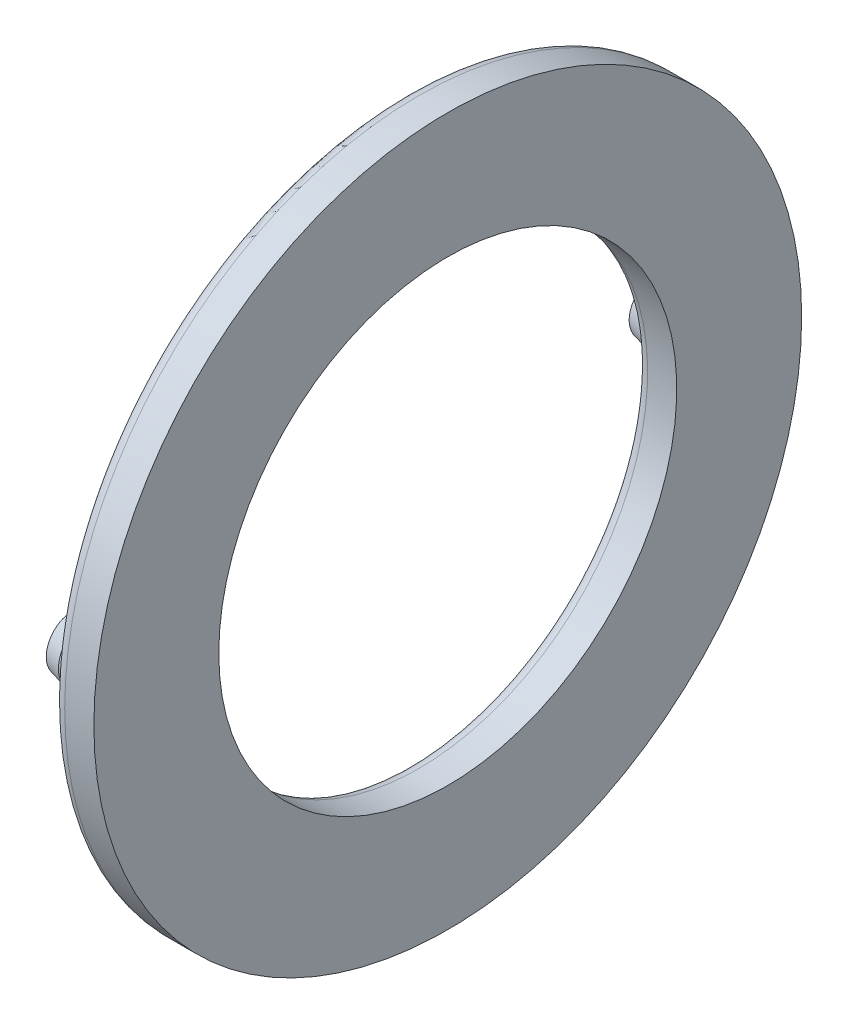
ISO-10303-21;
HEADER;
FILE_DESCRIPTION(('STEP AP214'),'2;1');
FILE_NAME('part.step','',(''),(''),'','','');
FILE_SCHEMA(('AUTOMOTIVE_DESIGN { 1 0 10303 214 1 1 1 1 }'));
ENDSEC;
DATA;
#1=APPLICATION_CONTEXT('core data for automotive mechanical design processes');
#2=APPLICATION_PROTOCOL_DEFINITION('international standard','automotive_design',2000,#1);
#3=PRODUCT_CONTEXT('',#1,'mechanical');
#4=PRODUCT('Part','Part','',(#3));
#5=PRODUCT_RELATED_PRODUCT_CATEGORY('part','',(#4));
#6=PRODUCT_DEFINITION_FORMATION('','',#4);
#7=PRODUCT_DEFINITION_CONTEXT('part definition',#1,'design');
#8=PRODUCT_DEFINITION('design','',#6,#7);
#9=PRODUCT_DEFINITION_SHAPE('','',#8);
#10=(LENGTH_UNIT() NAMED_UNIT(*) SI_UNIT(.MILLI.,.METRE.));
#11=(NAMED_UNIT(*) PLANE_ANGLE_UNIT() SI_UNIT($,.RADIAN.));
#12=(NAMED_UNIT(*) SI_UNIT($,.STERADIAN.) SOLID_ANGLE_UNIT());
#13=UNCERTAINTY_MEASURE_WITH_UNIT(LENGTH_MEASURE(1.E-05),#10,'distance_accuracy_value','');
#14=(GEOMETRIC_REPRESENTATION_CONTEXT(3) GLOBAL_UNCERTAINTY_ASSIGNED_CONTEXT((#13)) GLOBAL_UNIT_ASSIGNED_CONTEXT((#10,
#11,#12)) REPRESENTATION_CONTEXT('',''));
#15=CARTESIAN_POINT('',(0.,0.,0.));
#16=DIRECTION('',(0.,0.,1.));
#17=DIRECTION('',(1.,0.,0.));
#18=AXIS2_PLACEMENT_3D('',#15,#16,#17);
#19=CARTESIAN_POINT('',(5.5,15.,7.));
#20=DIRECTION('',(-1.,0.,0.));
#21=DIRECTION('',(0.,0.,1.));
#22=AXIS2_PLACEMENT_3D('',#19,#20,#21);
#23=PLANE('',#22);
#24=CARTESIAN_POINT('',(5.49999999998363,15.,7.));
#25=DIRECTION('',(1.,0.,0.));
#26=DIRECTION('',(0.,0.,-1.));
#27=AXIS2_PLACEMENT_3D('',#24,#25,#26);
#28=CIRCLE('',#27,0.642820323022304);
#29=CARTESIAN_POINT('',(5.49999999998363,15.,6.3571796769777));
#30=VERTEX_POINT('',#29);
#31=EDGE_CURVE('E18',#30,#30,#28,.T.);
#32=ORIENTED_EDGE('',*,*,#31,.F.);
#33=EDGE_LOOP('',(#32));
#34=FACE_BOUND('',#33,.T.);
#35=ADVANCED_FACE('F15',(#34),#23,.T.);
#36=CARTESIAN_POINT('',(5.50000000000001,15.,-7.));
#37=DIRECTION('',(-1.,0.,0.));
#38=DIRECTION('',(0.,0.,1.));
#39=AXIS2_PLACEMENT_3D('',#36,#37,#38);
#40=PLANE('',#39);
#41=CARTESIAN_POINT('',(5.49999999998363,15.,-7.));
#42=DIRECTION('',(1.,0.,0.));
#43=DIRECTION('',(0.,0.,-1.));
#44=AXIS2_PLACEMENT_3D('',#41,#42,#43);
#45=CIRCLE('',#44,0.642820323022316);
#46=CARTESIAN_POINT('',(5.49999999998363,15.,-7.64282032302232));
#47=VERTEX_POINT('',#46);
#48=EDGE_CURVE('E32',#47,#47,#45,.T.);
#49=ORIENTED_EDGE('',*,*,#48,.F.);
#50=EDGE_LOOP('',(#49));
#51=FACE_BOUND('',#50,.T.);
#52=ADVANCED_FACE('F45',(#51),#40,.T.);
#53=CARTESIAN_POINT('',(5.90000000005375,15.,7.));
#54=DIRECTION('',(1.,0.,0.));
#55=DIRECTION('',(0.,0.,-1.));
#56=AXIS2_PLACEMENT_3D('',#53,#54,#55);
#57=CONICAL_SURFACE('',#56,0.750000000024327,0.261799387824305);
#58=ORIENTED_EDGE('',*,*,#31,.T.);
#59=EDGE_LOOP('',(#58));
#60=FACE_BOUND('',#59,.T.);
#61=CARTESIAN_POINT('',(5.90000000000001,15.,7.));
#62=DIRECTION('',(-1.,0.,0.));
#63=DIRECTION('',(0.,0.,1.));
#64=AXIS2_PLACEMENT_3D('',#61,#62,#63);
#65=CIRCLE('',#64,0.75);
#66=CARTESIAN_POINT('',(5.90000000000001,15.,7.75));
#67=VERTEX_POINT('',#66);
#68=EDGE_CURVE('E30',#67,#67,#65,.F.);
#69=ORIENTED_EDGE('',*,*,#68,.F.);
#70=EDGE_LOOP('',(#69));
#71=FACE_BOUND('',#70,.T.);
#72=ADVANCED_FACE('F41',(#60,#71),#57,.T.);
#73=CARTESIAN_POINT('',(5.90000000005375,15.,-7.));
#74=DIRECTION('',(1.,0.,0.));
#75=DIRECTION('',(0.,0.,-1.));
#76=AXIS2_PLACEMENT_3D('',#73,#74,#75);
#77=CONICAL_SURFACE('',#76,0.750000000024339,0.261799387824305);
#78=ORIENTED_EDGE('',*,*,#48,.T.);
#79=EDGE_LOOP('',(#78));
#80=FACE_BOUND('',#79,.T.);
#81=CARTESIAN_POINT('',(5.90000000000002,15.,-7.));
#82=DIRECTION('',(-1.,0.,0.));
#83=DIRECTION('',(0.,0.,1.));
#84=AXIS2_PLACEMENT_3D('',#81,#82,#83);
#85=CIRCLE('',#84,0.75);
#86=CARTESIAN_POINT('',(5.90000000000002,15.,-6.25));
#87=VERTEX_POINT('',#86);
#88=EDGE_CURVE('E37',#87,#87,#85,.F.);
#89=ORIENTED_EDGE('',*,*,#88,.F.);
#90=EDGE_LOOP('',(#89));
#91=FACE_BOUND('',#90,.T.);
#92=ADVANCED_FACE('F202',(#80,#91),#77,.T.);
#93=CARTESIAN_POINT('',(5.5,15.,7.));
#94=DIRECTION('',(-1.,0.,0.));
#95=DIRECTION('',(0.,0.,1.));
#96=AXIS2_PLACEMENT_3D('',#93,#94,#95);
#97=CYLINDRICAL_SURFACE('',#96,0.75);
#98=ORIENTED_EDGE('',*,*,#68,.T.);
#99=EDGE_LOOP('',(#98));
#100=FACE_BOUND('',#99,.T.);
#101=CARTESIAN_POINT('',(6.3,15.,7.));
#102=DIRECTION('',(-1.,0.,0.));
#103=DIRECTION('',(0.,1.,0.));
#104=AXIS2_PLACEMENT_3D('',#101,#102,#103);
#105=CIRCLE('',#104,0.750000000000002);
#106=CARTESIAN_POINT('',(6.3,15.75,7.));
#107=VERTEX_POINT('',#106);
#108=EDGE_CURVE('E161',#107,#107,#105,.T.);
#109=ORIENTED_EDGE('',*,*,#108,.T.);
#110=EDGE_LOOP('',(#109));
#111=FACE_BOUND('',#110,.T.);
#112=ADVANCED_FACE('F199',(#100,#111),#97,.T.);
#113=CARTESIAN_POINT('',(5.50000000000001,15.,-7.));
#114=DIRECTION('',(-1.,0.,0.));
#115=DIRECTION('',(0.,0.,1.));
#116=AXIS2_PLACEMENT_3D('',#113,#114,#115);
#117=CYLINDRICAL_SURFACE('',#116,0.75);
#118=ORIENTED_EDGE('',*,*,#88,.T.);
#119=EDGE_LOOP('',(#118));
#120=FACE_BOUND('',#119,.T.);
#121=CARTESIAN_POINT('',(6.30000000000001,15.,-7.));
#122=DIRECTION('',(-1.,0.,0.));
#123=DIRECTION('',(0.,1.,0.));
#124=AXIS2_PLACEMENT_3D('',#121,#122,#123);
#125=CIRCLE('',#124,0.750000000000001);
#126=CARTESIAN_POINT('',(6.30000000000001,15.75,-7.));
#127=VERTEX_POINT('',#126);
#128=EDGE_CURVE('E157',#127,#127,#125,.T.);
#129=ORIENTED_EDGE('',*,*,#128,.T.);
#130=EDGE_LOOP('',(#129));
#131=FACE_BOUND('',#130,.T.);
#132=ADVANCED_FACE('F181',(#120,#131),#117,.T.);
#133=CARTESIAN_POINT('',(6.3,15.,7.));
#134=DIRECTION('',(-1.,0.,0.));
#135=DIRECTION('',(0.,1.,0.));
#136=AXIS2_PLACEMENT_3D('',#133,#134,#135);
#137=TOROIDAL_SURFACE('',#136,0.950000000000001,0.2);
#138=CARTESIAN_POINT('',(6.5,15.,7.));
#139=DIRECTION('',(-1.,0.,0.));
#140=DIRECTION('',(0.,1.,0.));
#141=AXIS2_PLACEMENT_3D('',#138,#139,#140);
#142=CIRCLE('',#141,0.950000000000001);
#143=CARTESIAN_POINT('',(6.5,15.95,7.));
#144=VERTEX_POINT('',#143);
#145=EDGE_CURVE('E160',#144,#144,#142,.F.);
#146=ORIENTED_EDGE('',*,*,#145,.F.);
#147=EDGE_LOOP('',(#146));
#148=FACE_BOUND('',#147,.T.);
#149=ORIENTED_EDGE('',*,*,#108,.F.);
#150=EDGE_LOOP('',(#149));
#151=FACE_BOUND('',#150,.T.);
#152=ADVANCED_FACE('F177',(#148,#151),#137,.F.);
#153=CARTESIAN_POINT('',(6.30000000000001,15.,-7.));
#154=DIRECTION('',(-1.,0.,0.));
#155=DIRECTION('',(0.,1.,0.));
#156=AXIS2_PLACEMENT_3D('',#153,#154,#155);
#157=TOROIDAL_SURFACE('',#156,0.95,0.2);
#158=CARTESIAN_POINT('',(6.50000000000001,15.,-7.));
#159=DIRECTION('',(-1.,0.,0.));
#160=DIRECTION('',(0.,1.,0.));
#161=AXIS2_PLACEMENT_3D('',#158,#159,#160);
#162=CIRCLE('',#161,0.95);
#163=CARTESIAN_POINT('',(6.50000000000001,15.95,-7.));
#164=VERTEX_POINT('',#163);
#165=EDGE_CURVE('E165',#164,#164,#162,.F.);
#166=ORIENTED_EDGE('',*,*,#165,.F.);
#167=EDGE_LOOP('',(#166));
#168=FACE_BOUND('',#167,.T.);
#169=ORIENTED_EDGE('',*,*,#128,.F.);
#170=EDGE_LOOP('',(#169));
#171=FACE_BOUND('',#170,.T.);
#172=ADVANCED_FACE('F105',(#168,#171),#157,.F.);
#173=CARTESIAN_POINT('',(6.5,15.,0.));
#174=DIRECTION('',(-1.,0.,0.));
#175=DIRECTION('',(0.,0.,1.));
#176=AXIS2_PLACEMENT_3D('',#173,#174,#175);
#177=PLANE('',#176);
#178=CARTESIAN_POINT('',(6.5,15.,0.));
#179=DIRECTION('',(-1.,0.,0.));
#180=DIRECTION('',(0.,1.,0.));
#181=AXIS2_PLACEMENT_3D('',#178,#179,#180);
#182=CIRCLE('',#181,5.8);
#183=CARTESIAN_POINT('',(6.5,20.8,0.));
#184=VERTEX_POINT('',#183);
#185=EDGE_CURVE('E85',#184,#184,#182,.T.);
#186=ORIENTED_EDGE('',*,*,#185,.F.);
#187=EDGE_LOOP('',(#186));
#188=FACE_BOUND('',#187,.T.);
#189=ORIENTED_EDGE('',*,*,#165,.T.);
#190=EDGE_LOOP('',(#189));
#191=FACE_BOUND('',#190,.T.);
#192=ORIENTED_EDGE('',*,*,#145,.T.);
#193=EDGE_LOOP('',(#192));
#194=FACE_BOUND('',#193,.T.);
#195=CARTESIAN_POINT('',(6.5,15.,0.));
#196=DIRECTION('',(1.,0.,0.));
#197=DIRECTION('',(0.,1.,0.));
#198=AXIS2_PLACEMENT_3D('',#195,#196,#197);
#199=CIRCLE('',#198,8.2);
#200=CARTESIAN_POINT('',(6.5,23.2,0.));
#201=VERTEX_POINT('',#200);
#202=EDGE_CURVE('E90',#201,#201,#199,.T.);
#203=ORIENTED_EDGE('',*,*,#202,.F.);
#204=EDGE_LOOP('',(#203));
#205=FACE_BOUND('',#204,.T.);
#206=ADVANCED_FACE('F96',(#188,#191,#194,#205),#177,.T.);
#207=CARTESIAN_POINT('',(6.8,15.,0.));
#208=DIRECTION('',(-1.,0.,0.));
#209=DIRECTION('',(0.,1.,0.));
#210=AXIS2_PLACEMENT_3D('',#207,#208,#209);
#211=TOROIDAL_SURFACE('',#210,8.2,0.3);
#212=ORIENTED_EDGE('',*,*,#202,.T.);
#213=EDGE_LOOP('',(#212));
#214=FACE_BOUND('',#213,.T.);
#215=CARTESIAN_POINT('',(6.8,15.,0.));
#216=DIRECTION('',(-1.,0.,0.));
#217=DIRECTION('',(0.,0.,1.));
#218=AXIS2_PLACEMENT_3D('',#215,#216,#217);
#219=CIRCLE('',#218,8.5);
#220=CARTESIAN_POINT('',(6.8,15.,8.5));
#221=VERTEX_POINT('',#220);
#222=EDGE_CURVE('E82',#221,#221,#219,.F.);
#223=ORIENTED_EDGE('',*,*,#222,.F.);
#224=EDGE_LOOP('',(#223));
#225=FACE_BOUND('',#224,.T.);
#226=ADVANCED_FACE('F72',(#214,#225),#211,.T.);
#227=CARTESIAN_POINT('',(6.8,15.,0.));
#228=DIRECTION('',(-1.,0.,0.));
#229=DIRECTION('',(0.,1.,0.));
#230=AXIS2_PLACEMENT_3D('',#227,#228,#229);
#231=TOROIDAL_SURFACE('',#230,5.8,0.3);
#232=CARTESIAN_POINT('',(6.8,15.,0.));
#233=DIRECTION('',(-1.,0.,0.));
#234=DIRECTION('',(0.,0.,1.));
#235=AXIS2_PLACEMENT_3D('',#232,#233,#234);
#236=CIRCLE('',#235,5.5);
#237=CARTESIAN_POINT('',(6.8,15.,5.5));
#238=VERTEX_POINT('',#237);
#239=EDGE_CURVE('E27',#238,#238,#236,.F.);
#240=ORIENTED_EDGE('',*,*,#239,.T.);
#241=EDGE_LOOP('',(#240));
#242=FACE_BOUND('',#241,.T.);
#243=ORIENTED_EDGE('',*,*,#185,.T.);
#244=EDGE_LOOP('',(#243));
#245=FACE_BOUND('',#244,.T.);
#246=ADVANCED_FACE('F66',(#242,#245),#231,.T.);
#247=CARTESIAN_POINT('',(6.5,15.,0.));
#248=DIRECTION('',(-1.,0.,0.));
#249=DIRECTION('',(0.,0.,1.));
#250=AXIS2_PLACEMENT_3D('',#247,#248,#249);
#251=CYLINDRICAL_SURFACE('',#250,8.5);
#252=CARTESIAN_POINT('',(7.5,15.,0.));
#253=DIRECTION('',(-1.,0.,0.));
#254=DIRECTION('',(0.,0.,1.));
#255=AXIS2_PLACEMENT_3D('',#252,#253,#254);
#256=CIRCLE('',#255,8.5);
#257=CARTESIAN_POINT('',(7.5,15.,8.5));
#258=VERTEX_POINT('',#257);
#259=EDGE_CURVE('E22',#258,#258,#256,.T.);
#260=ORIENTED_EDGE('',*,*,#259,.T.);
#261=EDGE_LOOP('',(#260));
#262=FACE_BOUND('',#261,.T.);
#263=ORIENTED_EDGE('',*,*,#222,.T.);
#264=EDGE_LOOP('',(#263));
#265=FACE_BOUND('',#264,.T.);
#266=ADVANCED_FACE('F59',(#262,#265),#251,.T.);
#267=CARTESIAN_POINT('',(6.5,15.,0.));
#268=DIRECTION('',(-1.,0.,0.));
#269=DIRECTION('',(0.,0.,1.));
#270=AXIS2_PLACEMENT_3D('',#267,#268,#269);
#271=CYLINDRICAL_SURFACE('',#270,5.5);
#272=ORIENTED_EDGE('',*,*,#239,.F.);
#273=EDGE_LOOP('',(#272));
#274=FACE_BOUND('',#273,.T.);
#275=CARTESIAN_POINT('',(7.5,15.,0.));
#276=DIRECTION('',(-1.,0.,0.));
#277=DIRECTION('',(0.,0.,1.));
#278=AXIS2_PLACEMENT_3D('',#275,#276,#277);
#279=CIRCLE('',#278,5.5);
#280=CARTESIAN_POINT('',(7.5,15.,5.5));
#281=VERTEX_POINT('',#280);
#282=EDGE_CURVE('E10',#281,#281,#279,.F.);
#283=ORIENTED_EDGE('',*,*,#282,.T.);
#284=EDGE_LOOP('',(#283));
#285=FACE_BOUND('',#284,.T.);
#286=ADVANCED_FACE('F53',(#274,#285),#271,.F.);
#287=CARTESIAN_POINT('',(7.5,15.,0.));
#288=DIRECTION('',(-1.,0.,0.));
#289=DIRECTION('',(0.,0.,1.));
#290=AXIS2_PLACEMENT_3D('',#287,#288,#289);
#291=PLANE('',#290);
#292=ORIENTED_EDGE('',*,*,#282,.F.);
#293=EDGE_LOOP('',(#292));
#294=FACE_BOUND('',#293,.T.);
#295=ORIENTED_EDGE('',*,*,#259,.F.);
#296=EDGE_LOOP('',(#295));
#297=FACE_BOUND('',#296,.T.);
#298=ADVANCED_FACE('F51',(#294,#297),#291,.F.);
#299=CLOSED_SHELL('',(#35,#52,#72,#92,#112,#132,#152,#172,#206,#226,#246,#266,#286,#298));
#300=MANIFOLD_SOLID_BREP('B1',#299);
#301=ADVANCED_BREP_SHAPE_REPRESENTATION('',(#18,#300),#14);
#302=SHAPE_DEFINITION_REPRESENTATION(#9,#301);
ENDSEC;
END-ISO-10303-21;
